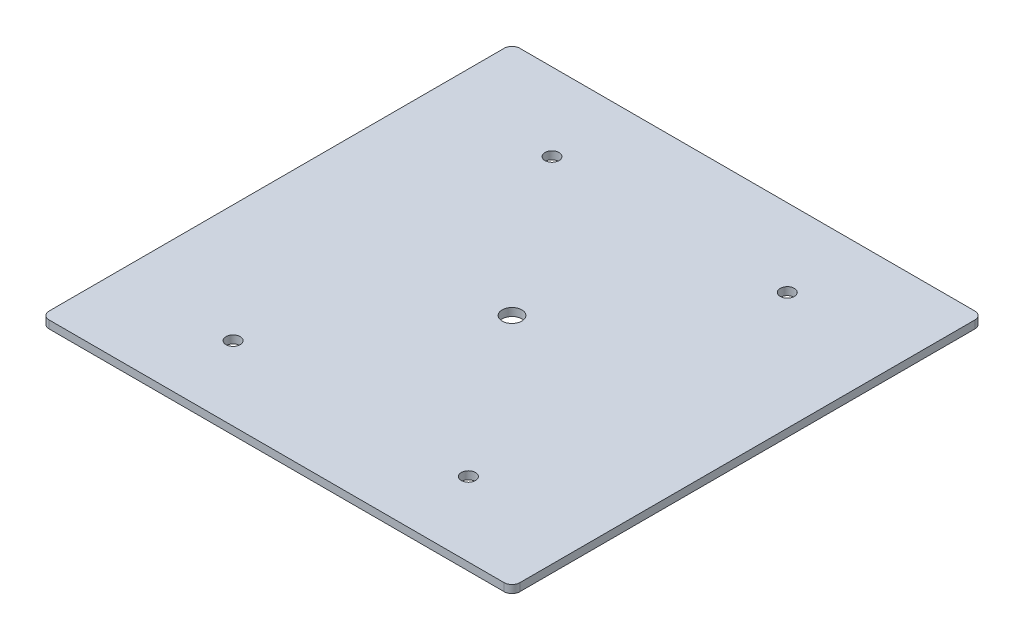
ISO-10303-21;
HEADER;
FILE_DESCRIPTION(('STEP AP214'),'2;1');
FILE_NAME('part.step','',(''),(''),'','','');
FILE_SCHEMA(('AUTOMOTIVE_DESIGN { 1 0 10303 214 1 1 1 1 }'));
ENDSEC;
DATA;
#1=APPLICATION_CONTEXT('core data for automotive mechanical design processes');
#2=APPLICATION_PROTOCOL_DEFINITION('international standard','automotive_design',2000,#1);
#3=PRODUCT_CONTEXT('',#1,'mechanical');
#4=PRODUCT('Part','Part','',(#3));
#5=PRODUCT_RELATED_PRODUCT_CATEGORY('part','',(#4));
#6=PRODUCT_DEFINITION_FORMATION('','',#4);
#7=PRODUCT_DEFINITION_CONTEXT('part definition',#1,'design');
#8=PRODUCT_DEFINITION('design','',#6,#7);
#9=PRODUCT_DEFINITION_SHAPE('','',#8);
#10=(LENGTH_UNIT() NAMED_UNIT(*) SI_UNIT(.MILLI.,.METRE.));
#11=(NAMED_UNIT(*) PLANE_ANGLE_UNIT() SI_UNIT($,.RADIAN.));
#12=(NAMED_UNIT(*) SI_UNIT($,.STERADIAN.) SOLID_ANGLE_UNIT());
#13=UNCERTAINTY_MEASURE_WITH_UNIT(LENGTH_MEASURE(1.E-05),#10,'distance_accuracy_value','');
#14=(GEOMETRIC_REPRESENTATION_CONTEXT(3) GLOBAL_UNCERTAINTY_ASSIGNED_CONTEXT((#13)) GLOBAL_UNIT_ASSIGNED_CONTEXT((#10,
#11,#12)) REPRESENTATION_CONTEXT('',''));
#15=CARTESIAN_POINT('',(0.,0.,0.));
#16=DIRECTION('',(0.,0.,1.));
#17=DIRECTION('',(1.,0.,0.));
#18=AXIS2_PLACEMENT_3D('',#15,#16,#17);
#19=CARTESIAN_POINT('',(-73.66,2.54,-73.66));
#20=DIRECTION('',(0.,-1.,0.));
#21=DIRECTION('',(0.,0.,-1.));
#22=AXIS2_PLACEMENT_3D('',#19,#20,#21);
#23=PLANE('',#22);
#24=CARTESIAN_POINT('',(0.,2.54,0.));
#25=DIRECTION('',(0.,1.,0.));
#26=DIRECTION('',(0.,0.,1.));
#27=AXIS2_PLACEMENT_3D('',#24,#25,#26);
#28=CIRCLE('',#27,3.175);
#29=CARTESIAN_POINT('',(0.,2.54,3.175));
#30=VERTEX_POINT('',#29);
#31=EDGE_CURVE('E185',#30,#30,#28,.T.);
#32=ORIENTED_EDGE('',*,*,#31,.F.);
#33=EDGE_LOOP('',(#32));
#34=FACE_BOUND('',#33,.T.);
#35=CARTESIAN_POINT('',(-38.1,2.54,52.2216929764761));
#36=DIRECTION('',(0.,1.,0.));
#37=DIRECTION('',(0.,0.,1.));
#38=AXIS2_PLACEMENT_3D('',#35,#36,#37);
#39=CIRCLE('',#38,2.286);
#40=CARTESIAN_POINT('',(-38.1,2.54,54.5076929764761));
#41=VERTEX_POINT('',#40);
#42=EDGE_CURVE('E191',#41,#41,#39,.T.);
#43=ORIENTED_EDGE('',*,*,#42,.F.);
#44=EDGE_LOOP('',(#43));
#45=FACE_BOUND('',#44,.T.);
#46=CARTESIAN_POINT('',(38.1,2.54,52.2216929764761));
#47=DIRECTION('',(0.,1.,0.));
#48=DIRECTION('',(0.,0.,1.));
#49=AXIS2_PLACEMENT_3D('',#46,#47,#48);
#50=CIRCLE('',#49,2.28599999999999);
#51=CARTESIAN_POINT('',(38.1,2.54,54.5076929764761));
#52=VERTEX_POINT('',#51);
#53=EDGE_CURVE('E197',#52,#52,#50,.T.);
#54=ORIENTED_EDGE('',*,*,#53,.F.);
#55=EDGE_LOOP('',(#54));
#56=FACE_BOUND('',#55,.T.);
#57=CARTESIAN_POINT('',(38.1,2.54,-51.0514589601965));
#58=DIRECTION('',(0.,1.,0.));
#59=DIRECTION('',(0.,0.,1.));
#60=AXIS2_PLACEMENT_3D('',#57,#58,#59);
#61=CIRCLE('',#60,2.286);
#62=CARTESIAN_POINT('',(38.1,2.54,-48.7654589601965));
#63=VERTEX_POINT('',#62);
#64=EDGE_CURVE('E203',#63,#63,#61,.T.);
#65=ORIENTED_EDGE('',*,*,#64,.F.);
#66=EDGE_LOOP('',(#65));
#67=FACE_BOUND('',#66,.T.);
#68=CARTESIAN_POINT('',(-38.1,2.54,-51.0514589601965));
#69=DIRECTION('',(0.,1.,0.));
#70=DIRECTION('',(0.,0.,1.));
#71=AXIS2_PLACEMENT_3D('',#68,#69,#70);
#72=CIRCLE('',#71,2.286);
#73=CARTESIAN_POINT('',(-38.1,2.54,-48.7654589601965));
#74=VERTEX_POINT('',#73);
#75=EDGE_CURVE('E179',#74,#74,#72,.T.);
#76=ORIENTED_EDGE('',*,*,#75,.F.);
#77=EDGE_LOOP('',(#76));
#78=FACE_BOUND('',#77,.T.);
#79=CARTESIAN_POINT('',(-73.66,2.54,-73.66));
#80=DIRECTION('',(0.,1.,0.));
#81=DIRECTION('',(0.,0.,-1.));
#82=AXIS2_PLACEMENT_3D('',#79,#80,#81);
#83=CIRCLE('',#82,2.54);
#84=CARTESIAN_POINT('',(-73.66,2.54,-76.2));
#85=VERTEX_POINT('',#84);
#86=CARTESIAN_POINT('',(-76.2,2.54,-73.66));
#87=VERTEX_POINT('',#86);
#88=EDGE_CURVE('E146',#85,#87,#83,.T.);
#89=ORIENTED_EDGE('',*,*,#88,.T.);
#90=DIRECTION('',(0.,0.,1.));
#91=VECTOR('',#90,1.);
#92=CARTESIAN_POINT('',(-76.2,2.54,-73.66));
#93=LINE('',#92,#91);
#94=CARTESIAN_POINT('',(-76.2,2.54,73.66));
#95=VERTEX_POINT('',#94);
#96=EDGE_CURVE('E95',#87,#95,#93,.T.);
#97=ORIENTED_EDGE('',*,*,#96,.T.);
#98=CARTESIAN_POINT('',(-73.66,2.54,73.66));
#99=DIRECTION('',(0.,1.,0.));
#100=DIRECTION('',(0.,0.,-1.));
#101=AXIS2_PLACEMENT_3D('',#98,#99,#100);
#102=CIRCLE('',#101,2.54);
#103=CARTESIAN_POINT('',(-73.66,2.54,76.2));
#104=VERTEX_POINT('',#103);
#105=EDGE_CURVE('E161',#95,#104,#102,.T.);
#106=ORIENTED_EDGE('',*,*,#105,.T.);
#107=DIRECTION('',(1.,0.,0.));
#108=VECTOR('',#107,1.);
#109=CARTESIAN_POINT('',(-73.66,2.54,76.2));
#110=LINE('',#109,#108);
#111=CARTESIAN_POINT('',(73.66,2.54,76.2));
#112=VERTEX_POINT('',#111);
#113=EDGE_CURVE('E173',#104,#112,#110,.T.);
#114=ORIENTED_EDGE('',*,*,#113,.T.);
#115=CARTESIAN_POINT('',(73.66,2.54,73.66));
#116=DIRECTION('',(0.,1.,0.));
#117=DIRECTION('',(0.,0.,-1.));
#118=AXIS2_PLACEMENT_3D('',#115,#116,#117);
#119=CIRCLE('',#118,2.54);
#120=CARTESIAN_POINT('',(76.2,2.54,73.66));
#121=VERTEX_POINT('',#120);
#122=EDGE_CURVE('E113',#112,#121,#119,.T.);
#123=ORIENTED_EDGE('',*,*,#122,.T.);
#124=DIRECTION('',(0.,0.,-1.));
#125=VECTOR('',#124,1.);
#126=CARTESIAN_POINT('',(76.2,2.54,-73.66));
#127=LINE('',#126,#125);
#128=CARTESIAN_POINT('',(76.2,2.54,-73.66));
#129=VERTEX_POINT('',#128);
#130=EDGE_CURVE('E108',#121,#129,#127,.T.);
#131=ORIENTED_EDGE('',*,*,#130,.T.);
#132=CARTESIAN_POINT('',(73.66,2.54,-73.66));
#133=DIRECTION('',(0.,1.,0.));
#134=DIRECTION('',(0.,0.,1.));
#135=AXIS2_PLACEMENT_3D('',#132,#133,#134);
#136=CIRCLE('',#135,2.54);
#137=CARTESIAN_POINT('',(73.66,2.54,-76.2));
#138=VERTEX_POINT('',#137);
#139=EDGE_CURVE('E111',#129,#138,#136,.T.);
#140=ORIENTED_EDGE('',*,*,#139,.T.);
#141=DIRECTION('',(-1.,0.,0.));
#142=VECTOR('',#141,1.);
#143=CARTESIAN_POINT('',(-73.66,2.54,-76.2));
#144=LINE('',#143,#142);
#145=EDGE_CURVE('E52',#138,#85,#144,.T.);
#146=ORIENTED_EDGE('',*,*,#145,.T.);
#147=EDGE_LOOP('',(#89,#97,#106,#114,#123,#131,#140,#146));
#148=FACE_BOUND('',#147,.T.);
#149=ADVANCED_FACE('F35',(#34,#45,#56,#67,#78,#148),#23,.F.);
#150=CARTESIAN_POINT('',(-73.66,0.,-73.66));
#151=DIRECTION('',(0.,-1.,0.));
#152=DIRECTION('',(0.,0.,-1.));
#153=AXIS2_PLACEMENT_3D('',#150,#151,#152);
#154=PLANE('',#153);
#155=CARTESIAN_POINT('',(0.,0.,0.));
#156=DIRECTION('',(0.,1.,0.));
#157=DIRECTION('',(0.,0.,1.));
#158=AXIS2_PLACEMENT_3D('',#155,#156,#157);
#159=CIRCLE('',#158,3.175);
#160=CARTESIAN_POINT('',(0.,0.,3.175));
#161=VERTEX_POINT('',#160);
#162=EDGE_CURVE('E188',#161,#161,#159,.T.);
#163=ORIENTED_EDGE('',*,*,#162,.T.);
#164=EDGE_LOOP('',(#163));
#165=FACE_BOUND('',#164,.T.);
#166=CARTESIAN_POINT('',(-38.1,0.,52.2216929764761));
#167=DIRECTION('',(0.,1.,0.));
#168=DIRECTION('',(0.,0.,1.));
#169=AXIS2_PLACEMENT_3D('',#166,#167,#168);
#170=CIRCLE('',#169,2.286);
#171=CARTESIAN_POINT('',(-38.1,0.,54.5076929764761));
#172=VERTEX_POINT('',#171);
#173=EDGE_CURVE('E194',#172,#172,#170,.T.);
#174=ORIENTED_EDGE('',*,*,#173,.T.);
#175=EDGE_LOOP('',(#174));
#176=FACE_BOUND('',#175,.T.);
#177=CARTESIAN_POINT('',(38.1,0.,52.2216929764761));
#178=DIRECTION('',(0.,1.,0.));
#179=DIRECTION('',(0.,0.,1.));
#180=AXIS2_PLACEMENT_3D('',#177,#178,#179);
#181=CIRCLE('',#180,2.28599999999999);
#182=CARTESIAN_POINT('',(38.1,0.,54.5076929764761));
#183=VERTEX_POINT('',#182);
#184=EDGE_CURVE('E200',#183,#183,#181,.T.);
#185=ORIENTED_EDGE('',*,*,#184,.T.);
#186=EDGE_LOOP('',(#185));
#187=FACE_BOUND('',#186,.T.);
#188=CARTESIAN_POINT('',(38.1,0.,-51.0514589601965));
#189=DIRECTION('',(0.,1.,0.));
#190=DIRECTION('',(0.,0.,1.));
#191=AXIS2_PLACEMENT_3D('',#188,#189,#190);
#192=CIRCLE('',#191,2.286);
#193=CARTESIAN_POINT('',(38.1,0.,-48.7654589601965));
#194=VERTEX_POINT('',#193);
#195=EDGE_CURVE('E182',#194,#194,#192,.T.);
#196=ORIENTED_EDGE('',*,*,#195,.T.);
#197=EDGE_LOOP('',(#196));
#198=FACE_BOUND('',#197,.T.);
#199=CARTESIAN_POINT('',(-38.1,0.,-51.0514589601965));
#200=DIRECTION('',(0.,1.,0.));
#201=DIRECTION('',(0.,0.,1.));
#202=AXIS2_PLACEMENT_3D('',#199,#200,#201);
#203=CIRCLE('',#202,2.286);
#204=CARTESIAN_POINT('',(-38.1,0.,-48.7654589601965));
#205=VERTEX_POINT('',#204);
#206=EDGE_CURVE('E135',#205,#205,#203,.T.);
#207=ORIENTED_EDGE('',*,*,#206,.T.);
#208=EDGE_LOOP('',(#207));
#209=FACE_BOUND('',#208,.T.);
#210=CARTESIAN_POINT('',(-73.66,0.,-73.66));
#211=DIRECTION('',(0.,1.,0.));
#212=DIRECTION('',(0.,0.,-1.));
#213=AXIS2_PLACEMENT_3D('',#210,#211,#212);
#214=CIRCLE('',#213,2.54);
#215=CARTESIAN_POINT('',(-73.66,0.,-76.2));
#216=VERTEX_POINT('',#215);
#217=CARTESIAN_POINT('',(-76.2,0.,-73.66));
#218=VERTEX_POINT('',#217);
#219=EDGE_CURVE('E131',#216,#218,#214,.T.);
#220=ORIENTED_EDGE('',*,*,#219,.F.);
#221=DIRECTION('',(-1.,0.,0.));
#222=VECTOR('',#221,1.);
#223=CARTESIAN_POINT('',(-73.66,0.,-76.2));
#224=LINE('',#223,#222);
#225=CARTESIAN_POINT('',(73.66,0.,-76.2));
#226=VERTEX_POINT('',#225);
#227=EDGE_CURVE('E87',#226,#216,#224,.T.);
#228=ORIENTED_EDGE('',*,*,#227,.F.);
#229=CARTESIAN_POINT('',(73.66,0.,-73.66));
#230=DIRECTION('',(0.,1.,0.));
#231=DIRECTION('',(0.,0.,1.));
#232=AXIS2_PLACEMENT_3D('',#229,#230,#231);
#233=CIRCLE('',#232,2.54);
#234=CARTESIAN_POINT('',(76.2,0.,-73.66));
#235=VERTEX_POINT('',#234);
#236=EDGE_CURVE('E81',#235,#226,#233,.T.);
#237=ORIENTED_EDGE('',*,*,#236,.F.);
#238=DIRECTION('',(0.,0.,-1.));
#239=VECTOR('',#238,1.);
#240=CARTESIAN_POINT('',(76.2,0.,-73.66));
#241=LINE('',#240,#239);
#242=CARTESIAN_POINT('',(76.2,0.,73.66));
#243=VERTEX_POINT('',#242);
#244=EDGE_CURVE('E121',#243,#235,#241,.T.);
#245=ORIENTED_EDGE('',*,*,#244,.F.);
#246=CARTESIAN_POINT('',(73.66,0.,73.66));
#247=DIRECTION('',(0.,1.,0.));
#248=DIRECTION('',(0.,0.,-1.));
#249=AXIS2_PLACEMENT_3D('',#246,#247,#248);
#250=CIRCLE('',#249,2.54);
#251=CARTESIAN_POINT('',(73.66,0.,76.2));
#252=VERTEX_POINT('',#251);
#253=EDGE_CURVE('E141',#252,#243,#250,.T.);
#254=ORIENTED_EDGE('',*,*,#253,.F.);
#255=DIRECTION('',(1.,0.,0.));
#256=VECTOR('',#255,1.);
#257=CARTESIAN_POINT('',(-73.66,0.,76.2));
#258=LINE('',#257,#256);
#259=CARTESIAN_POINT('',(-73.66,0.,76.2));
#260=VERTEX_POINT('',#259);
#261=EDGE_CURVE('E139',#260,#252,#258,.T.);
#262=ORIENTED_EDGE('',*,*,#261,.F.);
#263=CARTESIAN_POINT('',(-73.66,0.,73.66));
#264=DIRECTION('',(0.,1.,0.));
#265=DIRECTION('',(0.,0.,-1.));
#266=AXIS2_PLACEMENT_3D('',#263,#264,#265);
#267=CIRCLE('',#266,2.54);
#268=CARTESIAN_POINT('',(-76.2,0.,73.66));
#269=VERTEX_POINT('',#268);
#270=EDGE_CURVE('E137',#269,#260,#267,.T.);
#271=ORIENTED_EDGE('',*,*,#270,.F.);
#272=DIRECTION('',(0.,0.,1.));
#273=VECTOR('',#272,1.);
#274=CARTESIAN_POINT('',(-76.2,0.,-73.66));
#275=LINE('',#274,#273);
#276=EDGE_CURVE('E134',#218,#269,#275,.T.);
#277=ORIENTED_EDGE('',*,*,#276,.F.);
#278=EDGE_LOOP('',(#220,#228,#237,#245,#254,#262,#271,#277));
#279=FACE_BOUND('',#278,.T.);
#280=ADVANCED_FACE('F165',(#165,#176,#187,#198,#209,#279),#154,.T.);
#281=CARTESIAN_POINT('',(-73.66,2.54,-73.66));
#282=DIRECTION('',(0.,-1.,0.));
#283=DIRECTION('',(0.,0.,-1.));
#284=AXIS2_PLACEMENT_3D('',#281,#282,#283);
#285=CYLINDRICAL_SURFACE('',#284,2.54);
#286=ORIENTED_EDGE('',*,*,#219,.T.);
#287=DIRECTION('',(0.,-1.,0.));
#288=VECTOR('',#287,1.);
#289=CARTESIAN_POINT('',(-76.2,2.54,-73.66));
#290=LINE('',#289,#288);
#291=EDGE_CURVE('E11',#87,#218,#290,.T.);
#292=ORIENTED_EDGE('',*,*,#291,.F.);
#293=ORIENTED_EDGE('',*,*,#88,.F.);
#294=DIRECTION('',(0.,-1.,0.));
#295=VECTOR('',#294,1.);
#296=CARTESIAN_POINT('',(-73.66,2.54,-76.2));
#297=LINE('',#296,#295);
#298=EDGE_CURVE('E127',#85,#216,#297,.T.);
#299=ORIENTED_EDGE('',*,*,#298,.T.);
#300=EDGE_LOOP('',(#286,#292,#293,#299));
#301=FACE_BOUND('',#300,.T.);
#302=ADVANCED_FACE('F37',(#301),#285,.T.);
#303=CARTESIAN_POINT('',(-76.2,2.54,-73.66));
#304=DIRECTION('',(1.,0.,0.));
#305=DIRECTION('',(0.,0.,-1.));
#306=AXIS2_PLACEMENT_3D('',#303,#304,#305);
#307=PLANE('',#306);
#308=ORIENTED_EDGE('',*,*,#276,.T.);
#309=DIRECTION('',(0.,-1.,0.));
#310=VECTOR('',#309,1.);
#311=CARTESIAN_POINT('',(-76.2,2.54,73.66));
#312=LINE('',#311,#310);
#313=EDGE_CURVE('E44',#95,#269,#312,.T.);
#314=ORIENTED_EDGE('',*,*,#313,.F.);
#315=ORIENTED_EDGE('',*,*,#96,.F.);
#316=ORIENTED_EDGE('',*,*,#291,.T.);
#317=EDGE_LOOP('',(#308,#314,#315,#316));
#318=FACE_BOUND('',#317,.T.);
#319=ADVANCED_FACE('F250',(#318),#307,.F.);
#320=CARTESIAN_POINT('',(-73.66,2.54,73.66));
#321=DIRECTION('',(0.,-1.,0.));
#322=DIRECTION('',(0.,0.,-1.));
#323=AXIS2_PLACEMENT_3D('',#320,#321,#322);
#324=CYLINDRICAL_SURFACE('',#323,2.54);
#325=ORIENTED_EDGE('',*,*,#270,.T.);
#326=DIRECTION('',(0.,-1.,0.));
#327=VECTOR('',#326,1.);
#328=CARTESIAN_POINT('',(-73.66,2.54,76.2));
#329=LINE('',#328,#327);
#330=EDGE_CURVE('E153',#104,#260,#329,.T.);
#331=ORIENTED_EDGE('',*,*,#330,.F.);
#332=ORIENTED_EDGE('',*,*,#105,.F.);
#333=ORIENTED_EDGE('',*,*,#313,.T.);
#334=EDGE_LOOP('',(#325,#331,#332,#333));
#335=FACE_BOUND('',#334,.T.);
#336=ADVANCED_FACE('F159',(#335),#324,.T.);
#337=CARTESIAN_POINT('',(-73.66,2.54,76.2));
#338=DIRECTION('',(0.,0.,-1.));
#339=DIRECTION('',(-1.,0.,0.));
#340=AXIS2_PLACEMENT_3D('',#337,#338,#339);
#341=PLANE('',#340);
#342=ORIENTED_EDGE('',*,*,#261,.T.);
#343=DIRECTION('',(0.,-1.,0.));
#344=VECTOR('',#343,1.);
#345=CARTESIAN_POINT('',(73.66,2.54,76.2));
#346=LINE('',#345,#344);
#347=EDGE_CURVE('E150',#112,#252,#346,.T.);
#348=ORIENTED_EDGE('',*,*,#347,.F.);
#349=ORIENTED_EDGE('',*,*,#113,.F.);
#350=ORIENTED_EDGE('',*,*,#330,.T.);
#351=EDGE_LOOP('',(#342,#348,#349,#350));
#352=FACE_BOUND('',#351,.T.);
#353=ADVANCED_FACE('F169',(#352),#341,.F.);
#354=CARTESIAN_POINT('',(73.66,2.54,73.66));
#355=DIRECTION('',(0.,-1.,0.));
#356=DIRECTION('',(0.,0.,-1.));
#357=AXIS2_PLACEMENT_3D('',#354,#355,#356);
#358=CYLINDRICAL_SURFACE('',#357,2.54);
#359=ORIENTED_EDGE('',*,*,#253,.T.);
#360=DIRECTION('',(0.,-1.,0.));
#361=VECTOR('',#360,1.);
#362=CARTESIAN_POINT('',(76.2,2.54,73.66));
#363=LINE('',#362,#361);
#364=EDGE_CURVE('E122',#121,#243,#363,.T.);
#365=ORIENTED_EDGE('',*,*,#364,.F.);
#366=ORIENTED_EDGE('',*,*,#122,.F.);
#367=ORIENTED_EDGE('',*,*,#347,.T.);
#368=EDGE_LOOP('',(#359,#365,#366,#367));
#369=FACE_BOUND('',#368,.T.);
#370=ADVANCED_FACE('F172',(#369),#358,.T.);
#371=CARTESIAN_POINT('',(76.2,2.54,-73.66));
#372=DIRECTION('',(-1.,0.,0.));
#373=DIRECTION('',(0.,0.,1.));
#374=AXIS2_PLACEMENT_3D('',#371,#372,#373);
#375=PLANE('',#374);
#376=ORIENTED_EDGE('',*,*,#244,.T.);
#377=DIRECTION('',(0.,-1.,0.));
#378=VECTOR('',#377,1.);
#379=CARTESIAN_POINT('',(76.2,2.54,-73.66));
#380=LINE('',#379,#378);
#381=EDGE_CURVE('E118',#129,#235,#380,.T.);
#382=ORIENTED_EDGE('',*,*,#381,.F.);
#383=ORIENTED_EDGE('',*,*,#130,.F.);
#384=ORIENTED_EDGE('',*,*,#364,.T.);
#385=EDGE_LOOP('',(#376,#382,#383,#384));
#386=FACE_BOUND('',#385,.T.);
#387=ADVANCED_FACE('F119',(#386),#375,.F.);
#388=CARTESIAN_POINT('',(73.66,2.54,-73.66));
#389=DIRECTION('',(0.,-1.,0.));
#390=DIRECTION('',(0.,0.,-1.));
#391=AXIS2_PLACEMENT_3D('',#388,#389,#390);
#392=CYLINDRICAL_SURFACE('',#391,2.54);
#393=ORIENTED_EDGE('',*,*,#236,.T.);
#394=DIRECTION('',(0.,-1.,0.));
#395=VECTOR('',#394,1.);
#396=CARTESIAN_POINT('',(73.66,2.54,-76.2));
#397=LINE('',#396,#395);
#398=EDGE_CURVE('E123',#138,#226,#397,.T.);
#399=ORIENTED_EDGE('',*,*,#398,.F.);
#400=ORIENTED_EDGE('',*,*,#139,.F.);
#401=ORIENTED_EDGE('',*,*,#381,.T.);
#402=EDGE_LOOP('',(#393,#399,#400,#401));
#403=FACE_BOUND('',#402,.T.);
#404=ADVANCED_FACE('F125',(#403),#392,.T.);
#405=CARTESIAN_POINT('',(-73.66,2.54,-76.2));
#406=DIRECTION('',(0.,0.,1.));
#407=DIRECTION('',(1.,0.,0.));
#408=AXIS2_PLACEMENT_3D('',#405,#406,#407);
#409=PLANE('',#408);
#410=ORIENTED_EDGE('',*,*,#227,.T.);
#411=ORIENTED_EDGE('',*,*,#298,.F.);
#412=ORIENTED_EDGE('',*,*,#145,.F.);
#413=ORIENTED_EDGE('',*,*,#398,.T.);
#414=EDGE_LOOP('',(#410,#411,#412,#413));
#415=FACE_BOUND('',#414,.T.);
#416=ADVANCED_FACE('F226',(#415),#409,.F.);
#417=CARTESIAN_POINT('',(-38.1,0.,-51.0514589601965));
#418=DIRECTION('',(0.,1.,0.));
#419=DIRECTION('',(0.,0.,1.));
#420=AXIS2_PLACEMENT_3D('',#417,#418,#419);
#421=CYLINDRICAL_SURFACE('',#420,2.286);
#422=ORIENTED_EDGE('',*,*,#206,.F.);
#423=EDGE_LOOP('',(#422));
#424=FACE_BOUND('',#423,.T.);
#425=ORIENTED_EDGE('',*,*,#75,.T.);
#426=EDGE_LOOP('',(#425));
#427=FACE_BOUND('',#426,.T.);
#428=ADVANCED_FACE('F215',(#424,#427),#421,.F.);
#429=CARTESIAN_POINT('',(38.1,0.,-51.0514589601965));
#430=DIRECTION('',(0.,1.,0.));
#431=DIRECTION('',(0.,0.,1.));
#432=AXIS2_PLACEMENT_3D('',#429,#430,#431);
#433=CYLINDRICAL_SURFACE('',#432,2.286);
#434=ORIENTED_EDGE('',*,*,#195,.F.);
#435=EDGE_LOOP('',(#434));
#436=FACE_BOUND('',#435,.T.);
#437=ORIENTED_EDGE('',*,*,#64,.T.);
#438=EDGE_LOOP('',(#437));
#439=FACE_BOUND('',#438,.T.);
#440=ADVANCED_FACE('F211',(#436,#439),#433,.F.);
#441=CARTESIAN_POINT('',(38.1,0.,52.2216929764761));
#442=DIRECTION('',(0.,1.,0.));
#443=DIRECTION('',(0.,0.,1.));
#444=AXIS2_PLACEMENT_3D('',#441,#442,#443);
#445=CYLINDRICAL_SURFACE('',#444,2.28599999999999);
#446=ORIENTED_EDGE('',*,*,#184,.F.);
#447=EDGE_LOOP('',(#446));
#448=FACE_BOUND('',#447,.T.);
#449=ORIENTED_EDGE('',*,*,#53,.T.);
#450=EDGE_LOOP('',(#449));
#451=FACE_BOUND('',#450,.T.);
#452=ADVANCED_FACE('F214',(#448,#451),#445,.F.);
#453=CARTESIAN_POINT('',(-38.1,0.,52.2216929764761));
#454=DIRECTION('',(0.,1.,0.));
#455=DIRECTION('',(0.,0.,1.));
#456=AXIS2_PLACEMENT_3D('',#453,#454,#455);
#457=CYLINDRICAL_SURFACE('',#456,2.286);
#458=ORIENTED_EDGE('',*,*,#173,.F.);
#459=EDGE_LOOP('',(#458));
#460=FACE_BOUND('',#459,.T.);
#461=ORIENTED_EDGE('',*,*,#42,.T.);
#462=EDGE_LOOP('',(#461));
#463=FACE_BOUND('',#462,.T.);
#464=ADVANCED_FACE('F331',(#460,#463),#457,.F.);
#465=CARTESIAN_POINT('',(0.,0.,0.));
#466=DIRECTION('',(0.,1.,0.));
#467=DIRECTION('',(0.,0.,1.));
#468=AXIS2_PLACEMENT_3D('',#465,#466,#467);
#469=CYLINDRICAL_SURFACE('',#468,3.175);
#470=ORIENTED_EDGE('',*,*,#162,.F.);
#471=EDGE_LOOP('',(#470));
#472=FACE_BOUND('',#471,.T.);
#473=ORIENTED_EDGE('',*,*,#31,.T.);
#474=EDGE_LOOP('',(#473));
#475=FACE_BOUND('',#474,.T.);
#476=ADVANCED_FACE('F235',(#472,#475),#469,.F.);
#477=CLOSED_SHELL('',(#149,#280,#302,#319,#336,#353,#370,#387,#404,#416,#428,#440,#452,#464,#476));
#478=MANIFOLD_SOLID_BREP('B2',#477);
#479=ADVANCED_BREP_SHAPE_REPRESENTATION('',(#18,#478),#14);
#480=SHAPE_DEFINITION_REPRESENTATION(#9,#479);
ENDSEC;
END-ISO-10303-21;
